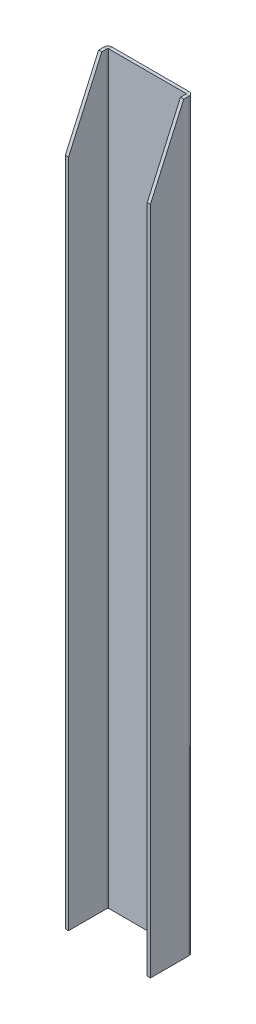
ISO-10303-21;
HEADER;
FILE_DESCRIPTION(('STEP AP214'),'2;1');
FILE_NAME('part.step','',(''),(''),'','','');
FILE_SCHEMA(('AUTOMOTIVE_DESIGN { 1 0 10303 214 1 1 1 1 }'));
ENDSEC;
DATA;
#1=APPLICATION_CONTEXT('core data for automotive mechanical design processes');
#2=APPLICATION_PROTOCOL_DEFINITION('international standard','automotive_design',2000,#1);
#3=PRODUCT_CONTEXT('',#1,'mechanical');
#4=PRODUCT('Part','Part','',(#3));
#5=PRODUCT_RELATED_PRODUCT_CATEGORY('part','',(#4));
#6=PRODUCT_DEFINITION_FORMATION('','',#4);
#7=PRODUCT_DEFINITION_CONTEXT('part definition',#1,'design');
#8=PRODUCT_DEFINITION('design','',#6,#7);
#9=PRODUCT_DEFINITION_SHAPE('','',#8);
#10=(LENGTH_UNIT() NAMED_UNIT(*) SI_UNIT(.MILLI.,.METRE.));
#11=(NAMED_UNIT(*) PLANE_ANGLE_UNIT() SI_UNIT($,.RADIAN.));
#12=(NAMED_UNIT(*) SI_UNIT($,.STERADIAN.) SOLID_ANGLE_UNIT());
#13=UNCERTAINTY_MEASURE_WITH_UNIT(LENGTH_MEASURE(1.E-05),#10,'distance_accuracy_value','');
#14=(GEOMETRIC_REPRESENTATION_CONTEXT(3) GLOBAL_UNCERTAINTY_ASSIGNED_CONTEXT((#13)) GLOBAL_UNIT_ASSIGNED_CONTEXT((#10,
#11,#12)) REPRESENTATION_CONTEXT('',''));
#15=CARTESIAN_POINT('',(0.,0.,0.));
#16=DIRECTION('',(0.,0.,1.));
#17=DIRECTION('',(1.,0.,0.));
#18=AXIS2_PLACEMENT_3D('',#15,#16,#17);
#19=CARTESIAN_POINT('',(-36.2634,700.,0.));
#20=DIRECTION('',(0.,1.,0.));
#21=DIRECTION('',(0.,0.,1.));
#22=AXIS2_PLACEMENT_3D('',#19,#20,#21);
#23=PLANE('',#22);
#24=DIRECTION('',(0.,0.,1.));
#25=VECTOR('',#24,1.);
#26=CARTESIAN_POINT('',(-36.2634,700.,0.));
#27=LINE('',#26,#25);
#28=CARTESIAN_POINT('',(-36.2634,700.,0.));
#29=VERTEX_POINT('',#28);
#30=CARTESIAN_POINT('',(-36.2634,700.,3.));
#31=VERTEX_POINT('',#30);
#32=EDGE_CURVE('E11',#29,#31,#27,.T.);
#33=ORIENTED_EDGE('',*,*,#32,.F.);
#34=CARTESIAN_POINT('',(-36.2634,700.,3.7366));
#35=DIRECTION('',(0.,1.,0.));
#36=DIRECTION('',(0.,0.,1.));
#37=AXIS2_PLACEMENT_3D('',#34,#35,#36);
#38=CIRCLE('',#37,3.7366);
#39=CARTESIAN_POINT('',(-40.,700.,3.7366));
#40=VERTEX_POINT('',#39);
#41=EDGE_CURVE('E182',#40,#29,#38,.F.);
#42=ORIENTED_EDGE('',*,*,#41,.F.);
#43=DIRECTION('',(-1.,0.,0.));
#44=VECTOR('',#43,1.);
#45=CARTESIAN_POINT('',(-37.,700.,3.7366));
#46=LINE('',#45,#44);
#47=CARTESIAN_POINT('',(-37.,700.,3.7366));
#48=VERTEX_POINT('',#47);
#49=EDGE_CURVE('E50',#48,#40,#46,.T.);
#50=ORIENTED_EDGE('',*,*,#49,.F.);
#51=CARTESIAN_POINT('',(-36.2634,700.,3.7366));
#52=DIRECTION('',(0.,1.,0.));
#53=DIRECTION('',(1.,0.,0.));
#54=AXIS2_PLACEMENT_3D('',#51,#52,#53);
#55=CIRCLE('',#54,0.7366);
#56=EDGE_CURVE('E192',#48,#31,#55,.F.);
#57=ORIENTED_EDGE('',*,*,#56,.T.);
#58=EDGE_LOOP('',(#33,#42,#50,#57));
#59=FACE_BOUND('',#58,.T.);
#60=ADVANCED_FACE('F42',(#59),#23,.T.);
#61=CARTESIAN_POINT('',(-37.,700.,3.7366));
#62=DIRECTION('',(0.,1.,0.));
#63=DIRECTION('',(0.,0.,1.));
#64=AXIS2_PLACEMENT_3D('',#61,#62,#63);
#65=PLANE('',#64);
#66=DIRECTION('',(1.,0.,0.));
#67=VECTOR('',#66,1.);
#68=CARTESIAN_POINT('',(-40.,700.,0.));
#69=LINE('',#68,#67);
#70=CARTESIAN_POINT('',(36.2634,700.,0.));
#71=VERTEX_POINT('',#70);
#72=EDGE_CURVE('E173',#29,#71,#69,.T.);
#73=ORIENTED_EDGE('',*,*,#72,.F.);
#74=ORIENTED_EDGE('',*,*,#32,.T.);
#75=DIRECTION('',(1.,0.,0.));
#76=VECTOR('',#75,1.);
#77=CARTESIAN_POINT('',(-40.,700.,3.));
#78=LINE('',#77,#76);
#79=CARTESIAN_POINT('',(36.2634,700.,2.99999999999999));
#80=VERTEX_POINT('',#79);
#81=EDGE_CURVE('E196',#31,#80,#78,.T.);
#82=ORIENTED_EDGE('',*,*,#81,.T.);
#83=DIRECTION('',(0.,0.,-1.));
#84=VECTOR('',#83,1.);
#85=CARTESIAN_POINT('',(36.2634,700.,2.99999999999999));
#86=LINE('',#85,#84);
#87=EDGE_CURVE('E299',#80,#71,#86,.T.);
#88=ORIENTED_EDGE('',*,*,#87,.T.);
#89=EDGE_LOOP('',(#73,#74,#82,#88));
#90=FACE_BOUND('',#89,.T.);
#91=ADVANCED_FACE('F335',(#90),#65,.T.);
#92=CARTESIAN_POINT('',(-40.,0.,3.7366));
#93=DIRECTION('',(0.,-1.,0.));
#94=DIRECTION('',(0.,0.,-1.));
#95=AXIS2_PLACEMENT_3D('',#92,#93,#94);
#96=PLANE('',#95);
#97=DIRECTION('',(1.,0.,0.));
#98=VECTOR('',#97,1.);
#99=CARTESIAN_POINT('',(-40.,0.,3.7366));
#100=LINE('',#99,#98);
#101=CARTESIAN_POINT('',(-40.,0.,3.7366));
#102=VERTEX_POINT('',#101);
#103=CARTESIAN_POINT('',(-37.,0.,3.7366));
#104=VERTEX_POINT('',#103);
#105=EDGE_CURVE('E308',#102,#104,#100,.T.);
#106=ORIENTED_EDGE('',*,*,#105,.F.);
#107=CARTESIAN_POINT('',(-36.2634,0.,3.7366));
#108=DIRECTION('',(0.,1.,0.));
#109=DIRECTION('',(0.,0.,1.));
#110=AXIS2_PLACEMENT_3D('',#107,#108,#109);
#111=CIRCLE('',#110,3.7366);
#112=CARTESIAN_POINT('',(-36.2634,0.,0.));
#113=VERTEX_POINT('',#112);
#114=EDGE_CURVE('E225',#102,#113,#111,.F.);
#115=ORIENTED_EDGE('',*,*,#114,.T.);
#116=DIRECTION('',(0.,0.,-1.));
#117=VECTOR('',#116,1.);
#118=CARTESIAN_POINT('',(-36.2634,0.,3.));
#119=LINE('',#118,#117);
#120=CARTESIAN_POINT('',(-36.2634,0.,3.));
#121=VERTEX_POINT('',#120);
#122=EDGE_CURVE('E305',#121,#113,#119,.T.);
#123=ORIENTED_EDGE('',*,*,#122,.F.);
#124=CARTESIAN_POINT('',(-36.2634,0.,3.7366));
#125=DIRECTION('',(0.,1.,0.));
#126=DIRECTION('',(1.,0.,0.));
#127=AXIS2_PLACEMENT_3D('',#124,#125,#126);
#128=CIRCLE('',#127,0.7366);
#129=EDGE_CURVE('E241',#104,#121,#128,.F.);
#130=ORIENTED_EDGE('',*,*,#129,.F.);
#131=EDGE_LOOP('',(#106,#115,#123,#130));
#132=FACE_BOUND('',#131,.T.);
#133=ADVANCED_FACE('F381',(#132),#96,.T.);
#134=CARTESIAN_POINT('',(-36.2634,0.,3.));
#135=DIRECTION('',(0.,-1.,0.));
#136=DIRECTION('',(0.,0.,-1.));
#137=AXIS2_PLACEMENT_3D('',#134,#135,#136);
#138=PLANE('',#137);
#139=DIRECTION('',(0.,0.,-1.));
#140=VECTOR('',#139,1.);
#141=CARTESIAN_POINT('',(-40.,0.,40.));
#142=LINE('',#141,#140);
#143=CARTESIAN_POINT('',(-40.,0.,40.));
#144=VERTEX_POINT('',#143);
#145=EDGE_CURVE('E229',#144,#102,#142,.T.);
#146=ORIENTED_EDGE('',*,*,#145,.T.);
#147=ORIENTED_EDGE('',*,*,#105,.T.);
#148=DIRECTION('',(0.,0.,-1.));
#149=VECTOR('',#148,1.);
#150=CARTESIAN_POINT('',(-37.,0.,40.));
#151=LINE('',#150,#149);
#152=CARTESIAN_POINT('',(-37.,0.,40.));
#153=VERTEX_POINT('',#152);
#154=EDGE_CURVE('E237',#153,#104,#151,.T.);
#155=ORIENTED_EDGE('',*,*,#154,.F.);
#156=DIRECTION('',(-1.,0.,0.));
#157=VECTOR('',#156,1.);
#158=CARTESIAN_POINT('',(-37.,0.,40.));
#159=LINE('',#158,#157);
#160=EDGE_CURVE('E233',#153,#144,#159,.T.);
#161=ORIENTED_EDGE('',*,*,#160,.T.);
#162=EDGE_LOOP('',(#146,#147,#155,#161));
#163=FACE_BOUND('',#162,.T.);
#164=ADVANCED_FACE('F378',(#163),#138,.T.);
#165=CARTESIAN_POINT('',(40.,700.,3.73659999999999));
#166=DIRECTION('',(0.,1.,0.));
#167=DIRECTION('',(0.,0.,1.));
#168=AXIS2_PLACEMENT_3D('',#165,#166,#167);
#169=PLANE('',#168);
#170=DIRECTION('',(-1.,0.,0.));
#171=VECTOR('',#170,1.);
#172=CARTESIAN_POINT('',(40.,700.,3.73659999999999));
#173=LINE('',#172,#171);
#174=CARTESIAN_POINT('',(40.,700.,3.73659999999999));
#175=VERTEX_POINT('',#174);
#176=CARTESIAN_POINT('',(37.,700.,3.73659999999999));
#177=VERTEX_POINT('',#176);
#178=EDGE_CURVE('E302',#175,#177,#173,.T.);
#179=ORIENTED_EDGE('',*,*,#178,.F.);
#180=CARTESIAN_POINT('',(36.2634,700.,3.73659999999999));
#181=DIRECTION('',(0.,1.,0.));
#182=DIRECTION('',(0.,0.,1.));
#183=AXIS2_PLACEMENT_3D('',#180,#181,#182);
#184=CIRCLE('',#183,3.7366);
#185=EDGE_CURVE('E167',#71,#175,#184,.F.);
#186=ORIENTED_EDGE('',*,*,#185,.F.);
#187=ORIENTED_EDGE('',*,*,#87,.F.);
#188=CARTESIAN_POINT('',(36.2634,700.,3.73659999999999));
#189=DIRECTION('',(0.,1.,0.));
#190=DIRECTION('',(1.,0.,0.));
#191=AXIS2_PLACEMENT_3D('',#188,#189,#190);
#192=CIRCLE('',#191,0.7366);
#193=EDGE_CURVE('E200',#80,#177,#192,.F.);
#194=ORIENTED_EDGE('',*,*,#193,.T.);
#195=EDGE_LOOP('',(#179,#186,#187,#194));
#196=FACE_BOUND('',#195,.T.);
#197=ADVANCED_FACE('F344',(#196),#169,.T.);
#198=CARTESIAN_POINT('',(36.2634,700.,2.99999999999999));
#199=DIRECTION('',(0.,1.,0.));
#200=DIRECTION('',(0.,0.,1.));
#201=AXIS2_PLACEMENT_3D('',#198,#199,#200);
#202=PLANE('',#201);
#203=DIRECTION('',(1.,0.,0.));
#204=VECTOR('',#203,1.);
#205=CARTESIAN_POINT('',(-116.664204030043,700.,8.73659999999999));
#206=LINE('',#205,#204);
#207=CARTESIAN_POINT('',(37.,700.,8.73659999999999));
#208=VERTEX_POINT('',#207);
#209=CARTESIAN_POINT('',(40.,700.,8.73659999999998));
#210=VERTEX_POINT('',#209);
#211=EDGE_CURVE('E142',#208,#210,#206,.T.);
#212=ORIENTED_EDGE('',*,*,#211,.T.);
#213=DIRECTION('',(0.,0.,1.));
#214=VECTOR('',#213,1.);
#215=CARTESIAN_POINT('',(40.,700.,0.));
#216=LINE('',#215,#214);
#217=EDGE_CURVE('E153',#175,#210,#216,.T.);
#218=ORIENTED_EDGE('',*,*,#217,.F.);
#219=ORIENTED_EDGE('',*,*,#178,.T.);
#220=DIRECTION('',(0.,0.,1.));
#221=VECTOR('',#220,1.);
#222=CARTESIAN_POINT('',(37.,700.,0.));
#223=LINE('',#222,#221);
#224=EDGE_CURVE('E156',#177,#208,#223,.T.);
#225=ORIENTED_EDGE('',*,*,#224,.T.);
#226=EDGE_LOOP('',(#212,#218,#219,#225));
#227=FACE_BOUND('',#226,.T.);
#228=ADVANCED_FACE('F152',(#227),#202,.T.);
#229=CARTESIAN_POINT('',(36.2634,0.,0.));
#230=DIRECTION('',(0.,-1.,0.));
#231=DIRECTION('',(0.,0.,-1.));
#232=AXIS2_PLACEMENT_3D('',#229,#230,#231);
#233=PLANE('',#232);
#234=DIRECTION('',(0.,0.,1.));
#235=VECTOR('',#234,1.);
#236=CARTESIAN_POINT('',(36.2634,0.,0.));
#237=LINE('',#236,#235);
#238=CARTESIAN_POINT('',(36.2634,0.,0.));
#239=VERTEX_POINT('',#238);
#240=CARTESIAN_POINT('',(36.2634,0.,2.99999999999999));
#241=VERTEX_POINT('',#240);
#242=EDGE_CURVE('E296',#239,#241,#237,.T.);
#243=ORIENTED_EDGE('',*,*,#242,.F.);
#244=CARTESIAN_POINT('',(36.2634,0.,3.73659999999999));
#245=DIRECTION('',(0.,1.,0.));
#246=DIRECTION('',(0.,0.,1.));
#247=AXIS2_PLACEMENT_3D('',#244,#245,#246);
#248=CIRCLE('',#247,3.7366);
#249=CARTESIAN_POINT('',(40.,0.,3.73659999999999));
#250=VERTEX_POINT('',#249);
#251=EDGE_CURVE('E217',#239,#250,#248,.F.);
#252=ORIENTED_EDGE('',*,*,#251,.T.);
#253=DIRECTION('',(1.,0.,0.));
#254=VECTOR('',#253,1.);
#255=CARTESIAN_POINT('',(37.,0.,3.73659999999999));
#256=LINE('',#255,#254);
#257=CARTESIAN_POINT('',(37.,0.,3.73659999999999));
#258=VERTEX_POINT('',#257);
#259=EDGE_CURVE('E293',#258,#250,#256,.T.);
#260=ORIENTED_EDGE('',*,*,#259,.F.);
#261=CARTESIAN_POINT('',(36.2634,0.,3.73659999999999));
#262=DIRECTION('',(0.,1.,0.));
#263=DIRECTION('',(1.,0.,0.));
#264=AXIS2_PLACEMENT_3D('',#261,#262,#263);
#265=CIRCLE('',#264,0.7366);
#266=EDGE_CURVE('E175',#241,#258,#265,.F.);
#267=ORIENTED_EDGE('',*,*,#266,.F.);
#268=EDGE_LOOP('',(#243,#252,#260,#267));
#269=FACE_BOUND('',#268,.T.);
#270=ADVANCED_FACE('F390',(#269),#233,.T.);
#271=CARTESIAN_POINT('',(37.,0.,3.73659999999999));
#272=DIRECTION('',(0.,-1.,0.));
#273=DIRECTION('',(0.,0.,-1.));
#274=AXIS2_PLACEMENT_3D('',#271,#272,#273);
#275=PLANE('',#274);
#276=DIRECTION('',(1.,0.,0.));
#277=VECTOR('',#276,1.);
#278=CARTESIAN_POINT('',(-40.,0.,0.));
#279=LINE('',#278,#277);
#280=EDGE_CURVE('E221',#113,#239,#279,.T.);
#281=ORIENTED_EDGE('',*,*,#280,.T.);
#282=ORIENTED_EDGE('',*,*,#242,.T.);
#283=DIRECTION('',(1.,0.,0.));
#284=VECTOR('',#283,1.);
#285=CARTESIAN_POINT('',(-40.,0.,3.));
#286=LINE('',#285,#284);
#287=EDGE_CURVE('E245',#121,#241,#286,.T.);
#288=ORIENTED_EDGE('',*,*,#287,.F.);
#289=ORIENTED_EDGE('',*,*,#122,.T.);
#290=EDGE_LOOP('',(#281,#282,#288,#289));
#291=FACE_BOUND('',#290,.T.);
#292=ADVANCED_FACE('F388',(#291),#275,.T.);
#293=CARTESIAN_POINT('',(37.,700.,0.));
#294=DIRECTION('',(1.,0.,0.));
#295=DIRECTION('',(0.,0.,-1.));
#296=AXIS2_PLACEMENT_3D('',#293,#294,#295);
#297=PLANE('',#296);
#298=DIRECTION('',(0.,-1.,0.));
#299=VECTOR('',#298,1.);
#300=CARTESIAN_POINT('',(37.,700.,40.));
#301=LINE('',#300,#299);
#302=CARTESIAN_POINT('',(37.,630.,40.));
#303=VERTEX_POINT('',#302);
#304=CARTESIAN_POINT('',(37.,0.,40.));
#305=VERTEX_POINT('',#304);
#306=EDGE_CURVE('E290',#303,#305,#301,.T.);
#307=ORIENTED_EDGE('',*,*,#306,.F.);
#308=DIRECTION('',(0.,0.913072807389599,-0.407796577236342));
#309=VECTOR('',#308,1.);
#310=CARTESIAN_POINT('',(37.,703.253055236445,7.28372047029896));
#311=LINE('',#310,#309);
#312=EDGE_CURVE('E209',#303,#208,#311,.T.);
#313=ORIENTED_EDGE('',*,*,#312,.T.);
#314=ORIENTED_EDGE('',*,*,#224,.F.);
#315=DIRECTION('',(0.,-1.,0.));
#316=VECTOR('',#315,1.);
#317=CARTESIAN_POINT('',(37.,700.,3.73659999999999));
#318=LINE('',#317,#316);
#319=EDGE_CURVE('E203',#177,#258,#318,.T.);
#320=ORIENTED_EDGE('',*,*,#319,.T.);
#321=DIRECTION('',(0.,0.,1.));
#322=VECTOR('',#321,1.);
#323=CARTESIAN_POINT('',(37.,0.,0.));
#324=LINE('',#323,#322);
#325=EDGE_CURVE('E204',#258,#305,#324,.T.);
#326=ORIENTED_EDGE('',*,*,#325,.T.);
#327=EDGE_LOOP('',(#307,#313,#314,#320,#326));
#328=FACE_BOUND('',#327,.T.);
#329=ADVANCED_FACE('F353',(#328),#297,.F.);
#330=CARTESIAN_POINT('',(40.,700.,40.));
#331=DIRECTION('',(0.,0.,1.));
#332=DIRECTION('',(1.,0.,0.));
#333=AXIS2_PLACEMENT_3D('',#330,#331,#332);
#334=PLANE('',#333);
#335=DIRECTION('',(1.,0.,0.));
#336=VECTOR('',#335,1.);
#337=CARTESIAN_POINT('',(-116.664204030043,630.,40.));
#338=LINE('',#337,#336);
#339=CARTESIAN_POINT('',(40.,630.,40.));
#340=VERTEX_POINT('',#339);
#341=EDGE_CURVE('E57',#303,#340,#338,.T.);
#342=ORIENTED_EDGE('',*,*,#341,.F.);
#343=ORIENTED_EDGE('',*,*,#306,.T.);
#344=DIRECTION('',(-1.,0.,0.));
#345=VECTOR('',#344,1.);
#346=CARTESIAN_POINT('',(40.,0.,40.));
#347=LINE('',#346,#345);
#348=CARTESIAN_POINT('',(40.,0.,40.));
#349=VERTEX_POINT('',#348);
#350=EDGE_CURVE('E208',#349,#305,#347,.T.);
#351=ORIENTED_EDGE('',*,*,#350,.F.);
#352=DIRECTION('',(0.,-1.,0.));
#353=VECTOR('',#352,1.);
#354=CARTESIAN_POINT('',(40.,700.,40.));
#355=LINE('',#354,#353);
#356=EDGE_CURVE('E287',#340,#349,#355,.T.);
#357=ORIENTED_EDGE('',*,*,#356,.F.);
#358=EDGE_LOOP('',(#342,#343,#351,#357));
#359=FACE_BOUND('',#358,.T.);
#360=ADVANCED_FACE('F395',(#359),#334,.T.);
#361=CARTESIAN_POINT('',(40.,700.,0.));
#362=DIRECTION('',(1.,0.,0.));
#363=DIRECTION('',(0.,0.,-1.));
#364=AXIS2_PLACEMENT_3D('',#361,#362,#363);
#365=PLANE('',#364);
#366=DIRECTION('',(0.,0.913072807389599,-0.407796577236342));
#367=VECTOR('',#366,1.);
#368=CARTESIAN_POINT('',(40.,700.,8.73659999999999));
#369=LINE('',#368,#367);
#370=EDGE_CURVE('E139',#340,#210,#369,.T.);
#371=ORIENTED_EDGE('',*,*,#370,.F.);
#372=ORIENTED_EDGE('',*,*,#356,.T.);
#373=DIRECTION('',(0.,0.,1.));
#374=VECTOR('',#373,1.);
#375=CARTESIAN_POINT('',(40.,0.,0.));
#376=LINE('',#375,#374);
#377=EDGE_CURVE('E213',#250,#349,#376,.T.);
#378=ORIENTED_EDGE('',*,*,#377,.F.);
#379=DIRECTION('',(0.,-1.,0.));
#380=VECTOR('',#379,1.);
#381=CARTESIAN_POINT('',(40.,700.,3.73659999999999));
#382=LINE('',#381,#380);
#383=EDGE_CURVE('E165',#175,#250,#382,.T.);
#384=ORIENTED_EDGE('',*,*,#383,.F.);
#385=ORIENTED_EDGE('',*,*,#217,.T.);
#386=EDGE_LOOP('',(#371,#372,#378,#384,#385));
#387=FACE_BOUND('',#386,.T.);
#388=ADVANCED_FACE('F162',(#387),#365,.T.);
#389=CARTESIAN_POINT('',(36.2634,700.,3.73659999999999));
#390=DIRECTION('',(0.,-1.,0.));
#391=DIRECTION('',(0.,0.,-1.));
#392=AXIS2_PLACEMENT_3D('',#389,#390,#391);
#393=CYLINDRICAL_SURFACE('',#392,3.7366);
#394=ORIENTED_EDGE('',*,*,#251,.F.);
#395=DIRECTION('',(0.,-1.,0.));
#396=VECTOR('',#395,1.);
#397=CARTESIAN_POINT('',(36.2634,700.,0.));
#398=LINE('',#397,#396);
#399=EDGE_CURVE('E281',#71,#239,#398,.T.);
#400=ORIENTED_EDGE('',*,*,#399,.F.);
#401=ORIENTED_EDGE('',*,*,#185,.T.);
#402=ORIENTED_EDGE('',*,*,#383,.T.);
#403=EDGE_LOOP('',(#394,#400,#401,#402));
#404=FACE_BOUND('',#403,.T.);
#405=ADVANCED_FACE('F343',(#404),#393,.T.);
#406=CARTESIAN_POINT('',(-40.,700.,0.));
#407=DIRECTION('',(0.,0.,-1.));
#408=DIRECTION('',(-1.,0.,0.));
#409=AXIS2_PLACEMENT_3D('',#406,#407,#408);
#410=PLANE('',#409);
#411=ORIENTED_EDGE('',*,*,#280,.F.);
#412=DIRECTION('',(0.,-1.,0.));
#413=VECTOR('',#412,1.);
#414=CARTESIAN_POINT('',(-36.2634,700.,0.));
#415=LINE('',#414,#413);
#416=EDGE_CURVE('E277',#29,#113,#415,.T.);
#417=ORIENTED_EDGE('',*,*,#416,.F.);
#418=ORIENTED_EDGE('',*,*,#72,.T.);
#419=ORIENTED_EDGE('',*,*,#399,.T.);
#420=EDGE_LOOP('',(#411,#417,#418,#419));
#421=FACE_BOUND('',#420,.T.);
#422=ADVANCED_FACE('F334',(#421),#410,.T.);
#423=CARTESIAN_POINT('',(-36.2634,700.,3.7366));
#424=DIRECTION('',(0.,-1.,0.));
#425=DIRECTION('',(0.,0.,-1.));
#426=AXIS2_PLACEMENT_3D('',#423,#424,#425);
#427=CYLINDRICAL_SURFACE('',#426,3.7366);
#428=ORIENTED_EDGE('',*,*,#114,.F.);
#429=DIRECTION('',(0.,-1.,0.));
#430=VECTOR('',#429,1.);
#431=CARTESIAN_POINT('',(-40.,700.,3.7366));
#432=LINE('',#431,#430);
#433=EDGE_CURVE('E273',#40,#102,#432,.T.);
#434=ORIENTED_EDGE('',*,*,#433,.F.);
#435=ORIENTED_EDGE('',*,*,#41,.T.);
#436=ORIENTED_EDGE('',*,*,#416,.T.);
#437=EDGE_LOOP('',(#428,#434,#435,#436));
#438=FACE_BOUND('',#437,.T.);
#439=ADVANCED_FACE('F324',(#438),#427,.T.);
#440=CARTESIAN_POINT('',(-40.,700.,40.));
#441=DIRECTION('',(-1.,0.,0.));
#442=DIRECTION('',(0.,0.,1.));
#443=AXIS2_PLACEMENT_3D('',#440,#441,#442);
#444=PLANE('',#443);
#445=DIRECTION('',(0.,0.913072807389599,-0.407796577236342));
#446=VECTOR('',#445,1.);
#447=CARTESIAN_POINT('',(-40.,700.,8.73659999999999));
#448=LINE('',#447,#446);
#449=CARTESIAN_POINT('',(-40.,630.,40.));
#450=VERTEX_POINT('',#449);
#451=CARTESIAN_POINT('',(-40.,700.,8.73659999999997));
#452=VERTEX_POINT('',#451);
#453=EDGE_CURVE('E159',#450,#452,#448,.T.);
#454=ORIENTED_EDGE('',*,*,#453,.T.);
#455=DIRECTION('',(0.,0.,-1.));
#456=VECTOR('',#455,1.);
#457=CARTESIAN_POINT('',(-40.,700.,40.));
#458=LINE('',#457,#456);
#459=EDGE_CURVE('E186',#452,#40,#458,.T.);
#460=ORIENTED_EDGE('',*,*,#459,.T.);
#461=ORIENTED_EDGE('',*,*,#433,.T.);
#462=ORIENTED_EDGE('',*,*,#145,.F.);
#463=DIRECTION('',(0.,-1.,0.));
#464=VECTOR('',#463,1.);
#465=CARTESIAN_POINT('',(-40.,700.,40.));
#466=LINE('',#465,#464);
#467=EDGE_CURVE('E270',#450,#144,#466,.T.);
#468=ORIENTED_EDGE('',*,*,#467,.F.);
#469=EDGE_LOOP('',(#454,#460,#461,#462,#468));
#470=FACE_BOUND('',#469,.T.);
#471=ADVANCED_FACE('F367',(#470),#444,.T.);
#472=CARTESIAN_POINT('',(-37.,700.,40.));
#473=DIRECTION('',(0.,0.,1.));
#474=DIRECTION('',(1.,0.,0.));
#475=AXIS2_PLACEMENT_3D('',#472,#473,#474);
#476=PLANE('',#475);
#477=CARTESIAN_POINT('',(-37.,630.,40.));
#478=VERTEX_POINT('',#477);
#479=EDGE_CURVE('E359',#450,#478,#338,.T.);
#480=ORIENTED_EDGE('',*,*,#479,.F.);
#481=ORIENTED_EDGE('',*,*,#467,.T.);
#482=ORIENTED_EDGE('',*,*,#160,.F.);
#483=DIRECTION('',(0.,-1.,0.));
#484=VECTOR('',#483,1.);
#485=CARTESIAN_POINT('',(-37.,700.,40.));
#486=LINE('',#485,#484);
#487=EDGE_CURVE('E267',#478,#153,#486,.T.);
#488=ORIENTED_EDGE('',*,*,#487,.F.);
#489=EDGE_LOOP('',(#480,#481,#482,#488));
#490=FACE_BOUND('',#489,.T.);
#491=ADVANCED_FACE('F372',(#490),#476,.T.);
#492=CARTESIAN_POINT('',(-37.,700.,40.));
#493=DIRECTION('',(-1.,0.,0.));
#494=DIRECTION('',(0.,0.,1.));
#495=AXIS2_PLACEMENT_3D('',#492,#493,#494);
#496=PLANE('',#495);
#497=DIRECTION('',(0.,0.,-1.));
#498=VECTOR('',#497,1.);
#499=CARTESIAN_POINT('',(-37.,700.,40.));
#500=LINE('',#499,#498);
#501=CARTESIAN_POINT('',(-37.,700.,8.73659999999998));
#502=VERTEX_POINT('',#501);
#503=EDGE_CURVE('E189',#502,#48,#500,.T.);
#504=ORIENTED_EDGE('',*,*,#503,.F.);
#505=DIRECTION('',(0.,-0.913072807389599,0.407796577236342));
#506=VECTOR('',#505,1.);
#507=CARTESIAN_POINT('',(-37.,688.359136611603,13.935642406526));
#508=LINE('',#507,#506);
#509=EDGE_CURVE('E65',#502,#478,#508,.T.);
#510=ORIENTED_EDGE('',*,*,#509,.T.);
#511=ORIENTED_EDGE('',*,*,#487,.T.);
#512=ORIENTED_EDGE('',*,*,#154,.T.);
#513=DIRECTION('',(0.,-1.,0.));
#514=VECTOR('',#513,1.);
#515=CARTESIAN_POINT('',(-37.,700.,3.7366));
#516=LINE('',#515,#514);
#517=EDGE_CURVE('E263',#48,#104,#516,.T.);
#518=ORIENTED_EDGE('',*,*,#517,.F.);
#519=EDGE_LOOP('',(#504,#510,#511,#512,#518));
#520=FACE_BOUND('',#519,.T.);
#521=ADVANCED_FACE('F376',(#520),#496,.F.);
#522=CARTESIAN_POINT('',(-36.2634,700.,3.7366));
#523=DIRECTION('',(0.,-1.,0.));
#524=DIRECTION('',(0.,0.,-1.));
#525=AXIS2_PLACEMENT_3D('',#522,#523,#524);
#526=CYLINDRICAL_SURFACE('',#525,0.7366);
#527=ORIENTED_EDGE('',*,*,#129,.T.);
#528=DIRECTION('',(0.,-1.,0.));
#529=VECTOR('',#528,1.);
#530=CARTESIAN_POINT('',(-36.2634,700.,3.));
#531=LINE('',#530,#529);
#532=EDGE_CURVE('E259',#31,#121,#531,.T.);
#533=ORIENTED_EDGE('',*,*,#532,.F.);
#534=ORIENTED_EDGE('',*,*,#56,.F.);
#535=ORIENTED_EDGE('',*,*,#517,.T.);
#536=EDGE_LOOP('',(#527,#533,#534,#535));
#537=FACE_BOUND('',#536,.T.);
#538=ADVANCED_FACE('F383',(#537),#526,.F.);
#539=CARTESIAN_POINT('',(-40.,700.,3.));
#540=DIRECTION('',(0.,0.,-1.));
#541=DIRECTION('',(-1.,0.,0.));
#542=AXIS2_PLACEMENT_3D('',#539,#540,#541);
#543=PLANE('',#542);
#544=ORIENTED_EDGE('',*,*,#287,.T.);
#545=DIRECTION('',(0.,-1.,0.));
#546=VECTOR('',#545,1.);
#547=CARTESIAN_POINT('',(36.2634,700.,2.99999999999999));
#548=LINE('',#547,#546);
#549=EDGE_CURVE('E255',#80,#241,#548,.T.);
#550=ORIENTED_EDGE('',*,*,#549,.F.);
#551=ORIENTED_EDGE('',*,*,#81,.F.);
#552=ORIENTED_EDGE('',*,*,#532,.T.);
#553=EDGE_LOOP('',(#544,#550,#551,#552));
#554=FACE_BOUND('',#553,.T.);
#555=ADVANCED_FACE('F386',(#554),#543,.F.);
#556=CARTESIAN_POINT('',(36.2634,700.,3.73659999999999));
#557=DIRECTION('',(0.,-1.,0.));
#558=DIRECTION('',(0.,0.,-1.));
#559=AXIS2_PLACEMENT_3D('',#556,#557,#558);
#560=CYLINDRICAL_SURFACE('',#559,0.7366);
#561=ORIENTED_EDGE('',*,*,#266,.T.);
#562=ORIENTED_EDGE('',*,*,#319,.F.);
#563=ORIENTED_EDGE('',*,*,#193,.F.);
#564=ORIENTED_EDGE('',*,*,#549,.T.);
#565=EDGE_LOOP('',(#561,#562,#563,#564));
#566=FACE_BOUND('',#565,.T.);
#567=ADVANCED_FACE('F348',(#566),#560,.F.);
#568=CARTESIAN_POINT('',(36.2634,700.,3.73659999999999));
#569=DIRECTION('',(0.,1.,0.));
#570=DIRECTION('',(1.,0.,0.));
#571=AXIS2_PLACEMENT_3D('',#568,#569,#570);
#572=PLANE('',#571);
#573=EDGE_CURVE('E158',#452,#502,#206,.T.);
#574=ORIENTED_EDGE('',*,*,#573,.T.);
#575=ORIENTED_EDGE('',*,*,#503,.T.);
#576=ORIENTED_EDGE('',*,*,#49,.T.);
#577=ORIENTED_EDGE('',*,*,#459,.F.);
#578=EDGE_LOOP('',(#574,#575,#576,#577));
#579=FACE_BOUND('',#578,.T.);
#580=ADVANCED_FACE('F317',(#579),#572,.T.);
#581=CARTESIAN_POINT('',(36.2634,0.,3.73659999999999));
#582=DIRECTION('',(0.,1.,0.));
#583=DIRECTION('',(1.,0.,0.));
#584=AXIS2_PLACEMENT_3D('',#581,#582,#583);
#585=PLANE('',#584);
#586=ORIENTED_EDGE('',*,*,#325,.F.);
#587=ORIENTED_EDGE('',*,*,#259,.T.);
#588=ORIENTED_EDGE('',*,*,#377,.T.);
#589=ORIENTED_EDGE('',*,*,#350,.T.);
#590=EDGE_LOOP('',(#586,#587,#588,#589));
#591=FACE_BOUND('',#590,.T.);
#592=ADVANCED_FACE('F392',(#591),#585,.F.);
#593=CARTESIAN_POINT('',(-116.664204030043,700.,8.73659999999999));
#594=DIRECTION('',(0.,-0.407796577236342,-0.913072807389599));
#595=DIRECTION('',(0.,0.913072807389599,-0.407796577236342));
#596=AXIS2_PLACEMENT_3D('',#593,#594,#595);
#597=PLANE('',#596);
#598=ORIENTED_EDGE('',*,*,#573,.F.);
#599=ORIENTED_EDGE('',*,*,#453,.F.);
#600=ORIENTED_EDGE('',*,*,#479,.T.);
#601=ORIENTED_EDGE('',*,*,#509,.F.);
#602=EDGE_LOOP('',(#598,#599,#600,#601));
#603=FACE_BOUND('',#602,.T.);
#604=ADVANCED_FACE('F369',(#603),#597,.F.);
#605=ORIENTED_EDGE('',*,*,#341,.T.);
#606=ORIENTED_EDGE('',*,*,#370,.T.);
#607=ORIENTED_EDGE('',*,*,#211,.F.);
#608=ORIENTED_EDGE('',*,*,#312,.F.);
#609=EDGE_LOOP('',(#605,#606,#607,#608));
#610=FACE_BOUND('',#609,.T.);
#611=ADVANCED_FACE('F141',(#610),#597,.F.);
#612=CLOSED_SHELL('',(#60,#91,#133,#164,#197,#228,#270,#292,#329,#360,#388,#405,#422,#439,#471,
#491,#521,#538,#555,#567,#580,#592,#604,#611));
#613=MANIFOLD_SOLID_BREP('B2',#612);
#614=ADVANCED_BREP_SHAPE_REPRESENTATION('',(#18,#613),#14);
#615=SHAPE_DEFINITION_REPRESENTATION(#9,#614);
ENDSEC;
END-ISO-10303-21;
